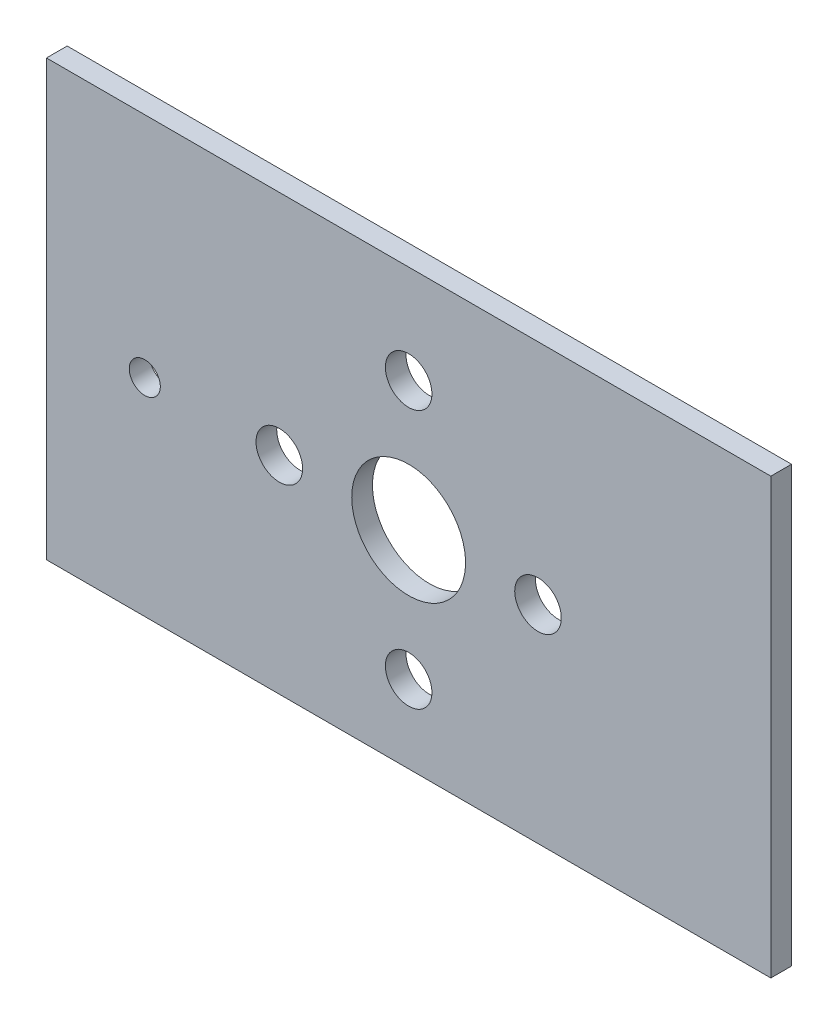
ISO-10303-21;
HEADER;
FILE_DESCRIPTION(('STEP AP214'),'2;1');
FILE_NAME('part.step','',(''),(''),'','','');
FILE_SCHEMA(('AUTOMOTIVE_DESIGN { 1 0 10303 214 1 1 1 1 }'));
ENDSEC;
DATA;
#1=APPLICATION_CONTEXT('core data for automotive mechanical design processes');
#2=APPLICATION_PROTOCOL_DEFINITION('international standard','automotive_design',2000,#1);
#3=PRODUCT_CONTEXT('',#1,'mechanical');
#4=PRODUCT('Part','Part','',(#3));
#5=PRODUCT_RELATED_PRODUCT_CATEGORY('part','',(#4));
#6=PRODUCT_DEFINITION_FORMATION('','',#4);
#7=PRODUCT_DEFINITION_CONTEXT('part definition',#1,'design');
#8=PRODUCT_DEFINITION('design','',#6,#7);
#9=PRODUCT_DEFINITION_SHAPE('','',#8);
#10=(LENGTH_UNIT() NAMED_UNIT(*) SI_UNIT(.MILLI.,.METRE.));
#11=(NAMED_UNIT(*) PLANE_ANGLE_UNIT() SI_UNIT($,.RADIAN.));
#12=(NAMED_UNIT(*) SI_UNIT($,.STERADIAN.) SOLID_ANGLE_UNIT());
#13=UNCERTAINTY_MEASURE_WITH_UNIT(LENGTH_MEASURE(1.E-05),#10,'distance_accuracy_value','');
#14=(GEOMETRIC_REPRESENTATION_CONTEXT(3) GLOBAL_UNCERTAINTY_ASSIGNED_CONTEXT((#13)) GLOBAL_UNIT_ASSIGNED_CONTEXT((#10,
#11,#12)) REPRESENTATION_CONTEXT('',''));
#15=CARTESIAN_POINT('',(0.,0.,0.));
#16=DIRECTION('',(0.,0.,1.));
#17=DIRECTION('',(1.,0.,0.));
#18=AXIS2_PLACEMENT_3D('',#15,#16,#17);
#19=CARTESIAN_POINT('',(0.,0.,2.));
#20=DIRECTION('',(1.,0.,0.));
#21=DIRECTION('',(0.,0.,-1.));
#22=AXIS2_PLACEMENT_3D('',#19,#20,#21);
#23=PLANE('',#22);
#24=DIRECTION('',(0.,-1.,0.));
#25=VECTOR('',#24,1.);
#26=CARTESIAN_POINT('',(0.,0.,0.));
#27=LINE('',#26,#25);
#28=CARTESIAN_POINT('',(0.,42.,0.));
#29=VERTEX_POINT('',#28);
#30=CARTESIAN_POINT('',(0.,0.,0.));
#31=VERTEX_POINT('',#30);
#32=EDGE_CURVE('E96',#29,#31,#27,.T.);
#33=ORIENTED_EDGE('',*,*,#32,.T.);
#34=DIRECTION('',(0.,0.,-1.));
#35=VECTOR('',#34,1.);
#36=CARTESIAN_POINT('',(0.,0.,2.));
#37=LINE('',#36,#35);
#38=CARTESIAN_POINT('',(0.,0.,2.));
#39=VERTEX_POINT('',#38);
#40=EDGE_CURVE('E11',#39,#31,#37,.T.);
#41=ORIENTED_EDGE('',*,*,#40,.F.);
#42=DIRECTION('',(0.,-1.,0.));
#43=VECTOR('',#42,1.);
#44=CARTESIAN_POINT('',(0.,0.,2.));
#45=LINE('',#44,#43);
#46=CARTESIAN_POINT('',(0.,42.,2.));
#47=VERTEX_POINT('',#46);
#48=EDGE_CURVE('E84',#47,#39,#45,.T.);
#49=ORIENTED_EDGE('',*,*,#48,.F.);
#50=DIRECTION('',(0.,0.,-1.));
#51=VECTOR('',#50,1.);
#52=CARTESIAN_POINT('',(0.,42.,2.));
#53=LINE('',#52,#51);
#54=EDGE_CURVE('E92',#47,#29,#53,.T.);
#55=ORIENTED_EDGE('',*,*,#54,.T.);
#56=EDGE_LOOP('',(#33,#41,#49,#55));
#57=FACE_BOUND('',#56,.T.);
#58=ADVANCED_FACE('F33',(#57),#23,.F.);
#59=CARTESIAN_POINT('',(0.,0.,2.));
#60=DIRECTION('',(0.,1.,0.));
#61=DIRECTION('',(0.,0.,1.));
#62=AXIS2_PLACEMENT_3D('',#59,#60,#61);
#63=PLANE('',#62);
#64=DIRECTION('',(1.,0.,0.));
#65=VECTOR('',#64,1.);
#66=CARTESIAN_POINT('',(0.,0.,0.));
#67=LINE('',#66,#65);
#68=CARTESIAN_POINT('',(70.,0.,0.));
#69=VERTEX_POINT('',#68);
#70=EDGE_CURVE('E88',#31,#69,#67,.T.);
#71=ORIENTED_EDGE('',*,*,#70,.T.);
#72=DIRECTION('',(0.,0.,-1.));
#73=VECTOR('',#72,1.);
#74=CARTESIAN_POINT('',(70.,0.,2.));
#75=LINE('',#74,#73);
#76=CARTESIAN_POINT('',(70.,0.,2.));
#77=VERTEX_POINT('',#76);
#78=EDGE_CURVE('E41',#77,#69,#75,.T.);
#79=ORIENTED_EDGE('',*,*,#78,.F.);
#80=DIRECTION('',(1.,0.,0.));
#81=VECTOR('',#80,1.);
#82=CARTESIAN_POINT('',(0.,0.,2.));
#83=LINE('',#82,#81);
#84=EDGE_CURVE('E79',#39,#77,#83,.T.);
#85=ORIENTED_EDGE('',*,*,#84,.F.);
#86=ORIENTED_EDGE('',*,*,#40,.T.);
#87=EDGE_LOOP('',(#71,#79,#85,#86));
#88=FACE_BOUND('',#87,.T.);
#89=ADVANCED_FACE('F87',(#88),#63,.F.);
#90=CARTESIAN_POINT('',(70.,0.,2.));
#91=DIRECTION('',(-1.,0.,0.));
#92=DIRECTION('',(0.,0.,1.));
#93=AXIS2_PLACEMENT_3D('',#90,#91,#92);
#94=PLANE('',#93);
#95=DIRECTION('',(0.,1.,0.));
#96=VECTOR('',#95,1.);
#97=CARTESIAN_POINT('',(70.,0.,0.));
#98=LINE('',#97,#96);
#99=CARTESIAN_POINT('',(70.,42.,0.));
#100=VERTEX_POINT('',#99);
#101=EDGE_CURVE('E66',#69,#100,#98,.T.);
#102=ORIENTED_EDGE('',*,*,#101,.T.);
#103=DIRECTION('',(0.,0.,-1.));
#104=VECTOR('',#103,1.);
#105=CARTESIAN_POINT('',(70.,42.,2.));
#106=LINE('',#105,#104);
#107=CARTESIAN_POINT('',(70.,42.,2.));
#108=VERTEX_POINT('',#107);
#109=EDGE_CURVE('E89',#108,#100,#106,.T.);
#110=ORIENTED_EDGE('',*,*,#109,.F.);
#111=DIRECTION('',(0.,1.,0.));
#112=VECTOR('',#111,1.);
#113=CARTESIAN_POINT('',(70.,0.,2.));
#114=LINE('',#113,#112);
#115=EDGE_CURVE('E82',#77,#108,#114,.T.);
#116=ORIENTED_EDGE('',*,*,#115,.F.);
#117=ORIENTED_EDGE('',*,*,#78,.T.);
#118=EDGE_LOOP('',(#102,#110,#116,#117));
#119=FACE_BOUND('',#118,.T.);
#120=ADVANCED_FACE('F90',(#119),#94,.F.);
#121=CARTESIAN_POINT('',(0.,42.,2.));
#122=DIRECTION('',(0.,-1.,0.));
#123=DIRECTION('',(0.,0.,-1.));
#124=AXIS2_PLACEMENT_3D('',#121,#122,#123);
#125=PLANE('',#124);
#126=DIRECTION('',(-1.,0.,0.));
#127=VECTOR('',#126,1.);
#128=CARTESIAN_POINT('',(0.,42.,0.));
#129=LINE('',#128,#127);
#130=EDGE_CURVE('E72',#100,#29,#129,.T.);
#131=ORIENTED_EDGE('',*,*,#130,.T.);
#132=ORIENTED_EDGE('',*,*,#54,.F.);
#133=DIRECTION('',(-1.,0.,0.));
#134=VECTOR('',#133,1.);
#135=CARTESIAN_POINT('',(0.,42.,2.));
#136=LINE('',#135,#134);
#137=EDGE_CURVE('E49',#108,#47,#136,.T.);
#138=ORIENTED_EDGE('',*,*,#137,.F.);
#139=ORIENTED_EDGE('',*,*,#109,.T.);
#140=EDGE_LOOP('',(#131,#132,#138,#139));
#141=FACE_BOUND('',#140,.T.);
#142=ADVANCED_FACE('F104',(#141),#125,.F.);
#143=CARTESIAN_POINT('',(0.,0.,2.));
#144=DIRECTION('',(0.,0.,-1.));
#145=DIRECTION('',(-1.,0.,0.));
#146=AXIS2_PLACEMENT_3D('',#143,#144,#145);
#147=PLANE('',#146);
#148=CARTESIAN_POINT('',(9.50000000000001,20.,2.));
#149=DIRECTION('',(0.,0.,-1.));
#150=DIRECTION('',(-1.,0.,0.));
#151=AXIS2_PLACEMENT_3D('',#148,#149,#150);
#152=CIRCLE('',#151,1.5);
#153=CARTESIAN_POINT('',(8.,20.,2.));
#154=VERTEX_POINT('',#153);
#155=EDGE_CURVE('E137',#154,#154,#152,.T.);
#156=ORIENTED_EDGE('',*,*,#155,.T.);
#157=EDGE_LOOP('',(#156));
#158=FACE_BOUND('',#157,.T.);
#159=CARTESIAN_POINT('',(35.,20.,2.));
#160=DIRECTION('',(0.,0.,-1.));
#161=DIRECTION('',(-1.,0.,0.));
#162=AXIS2_PLACEMENT_3D('',#159,#160,#161);
#163=CIRCLE('',#162,5.5);
#164=CARTESIAN_POINT('',(29.5,20.,2.));
#165=VERTEX_POINT('',#164);
#166=EDGE_CURVE('E133',#165,#165,#163,.T.);
#167=ORIENTED_EDGE('',*,*,#166,.T.);
#168=EDGE_LOOP('',(#167));
#169=FACE_BOUND('',#168,.T.);
#170=CARTESIAN_POINT('',(35.,32.5,2.));
#171=DIRECTION('',(0.,0.,-1.));
#172=DIRECTION('',(-1.,0.,0.));
#173=AXIS2_PLACEMENT_3D('',#170,#171,#172);
#174=CIRCLE('',#173,2.25);
#175=CARTESIAN_POINT('',(32.75,32.5,2.));
#176=VERTEX_POINT('',#175);
#177=EDGE_CURVE('E127',#176,#176,#174,.T.);
#178=ORIENTED_EDGE('',*,*,#177,.T.);
#179=EDGE_LOOP('',(#178));
#180=FACE_BOUND('',#179,.T.);
#181=CARTESIAN_POINT('',(47.5,20.,2.));
#182=DIRECTION('',(0.,0.,-1.));
#183=DIRECTION('',(-1.,0.,0.));
#184=AXIS2_PLACEMENT_3D('',#181,#182,#183);
#185=CIRCLE('',#184,2.25);
#186=CARTESIAN_POINT('',(45.25,20.,2.));
#187=VERTEX_POINT('',#186);
#188=EDGE_CURVE('E121',#187,#187,#185,.T.);
#189=ORIENTED_EDGE('',*,*,#188,.T.);
#190=EDGE_LOOP('',(#189));
#191=FACE_BOUND('',#190,.T.);
#192=CARTESIAN_POINT('',(35.,7.5,2.));
#193=DIRECTION('',(0.,0.,-1.));
#194=DIRECTION('',(-1.,0.,0.));
#195=AXIS2_PLACEMENT_3D('',#192,#193,#194);
#196=CIRCLE('',#195,2.25);
#197=CARTESIAN_POINT('',(32.75,7.5,2.));
#198=VERTEX_POINT('',#197);
#199=EDGE_CURVE('E115',#198,#198,#196,.T.);
#200=ORIENTED_EDGE('',*,*,#199,.T.);
#201=EDGE_LOOP('',(#200));
#202=FACE_BOUND('',#201,.T.);
#203=CARTESIAN_POINT('',(22.5,20.,2.));
#204=DIRECTION('',(0.,0.,-1.));
#205=DIRECTION('',(-1.,0.,0.));
#206=AXIS2_PLACEMENT_3D('',#203,#204,#205);
#207=CIRCLE('',#206,2.25);
#208=CARTESIAN_POINT('',(20.25,20.,2.));
#209=VERTEX_POINT('',#208);
#210=EDGE_CURVE('E99',#209,#209,#207,.T.);
#211=ORIENTED_EDGE('',*,*,#210,.T.);
#212=EDGE_LOOP('',(#211));
#213=FACE_BOUND('',#212,.T.);
#214=ORIENTED_EDGE('',*,*,#48,.T.);
#215=ORIENTED_EDGE('',*,*,#84,.T.);
#216=ORIENTED_EDGE('',*,*,#115,.T.);
#217=ORIENTED_EDGE('',*,*,#137,.T.);
#218=EDGE_LOOP('',(#214,#215,#216,#217));
#219=FACE_BOUND('',#218,.T.);
#220=ADVANCED_FACE('F80',(#158,#169,#180,#191,#202,#213,#219),#147,.F.);
#221=CARTESIAN_POINT('',(0.,0.,0.));
#222=DIRECTION('',(0.,0.,-1.));
#223=DIRECTION('',(-1.,0.,0.));
#224=AXIS2_PLACEMENT_3D('',#221,#222,#223);
#225=PLANE('',#224);
#226=CARTESIAN_POINT('',(9.50000000000001,20.,0.));
#227=DIRECTION('',(0.,0.,-1.));
#228=DIRECTION('',(-1.,0.,0.));
#229=AXIS2_PLACEMENT_3D('',#226,#227,#228);
#230=CIRCLE('',#229,1.5);
#231=CARTESIAN_POINT('',(8.,20.,0.));
#232=VERTEX_POINT('',#231);
#233=EDGE_CURVE('E140',#232,#232,#230,.T.);
#234=ORIENTED_EDGE('',*,*,#233,.F.);
#235=EDGE_LOOP('',(#234));
#236=FACE_BOUND('',#235,.T.);
#237=CARTESIAN_POINT('',(35.,20.,0.));
#238=DIRECTION('',(0.,0.,-1.));
#239=DIRECTION('',(-1.,0.,0.));
#240=AXIS2_PLACEMENT_3D('',#237,#238,#239);
#241=CIRCLE('',#240,5.5);
#242=CARTESIAN_POINT('',(29.5,20.,0.));
#243=VERTEX_POINT('',#242);
#244=EDGE_CURVE('E134',#243,#243,#241,.T.);
#245=ORIENTED_EDGE('',*,*,#244,.F.);
#246=EDGE_LOOP('',(#245));
#247=FACE_BOUND('',#246,.T.);
#248=CARTESIAN_POINT('',(35.,32.5,0.));
#249=DIRECTION('',(0.,0.,-1.));
#250=DIRECTION('',(-1.,0.,0.));
#251=AXIS2_PLACEMENT_3D('',#248,#249,#250);
#252=CIRCLE('',#251,2.25);
#253=CARTESIAN_POINT('',(32.75,32.5,0.));
#254=VERTEX_POINT('',#253);
#255=EDGE_CURVE('E130',#254,#254,#252,.T.);
#256=ORIENTED_EDGE('',*,*,#255,.F.);
#257=EDGE_LOOP('',(#256));
#258=FACE_BOUND('',#257,.T.);
#259=CARTESIAN_POINT('',(47.5,20.,0.));
#260=DIRECTION('',(0.,0.,-1.));
#261=DIRECTION('',(-1.,0.,0.));
#262=AXIS2_PLACEMENT_3D('',#259,#260,#261);
#263=CIRCLE('',#262,2.25);
#264=CARTESIAN_POINT('',(45.25,20.,0.));
#265=VERTEX_POINT('',#264);
#266=EDGE_CURVE('E124',#265,#265,#263,.T.);
#267=ORIENTED_EDGE('',*,*,#266,.F.);
#268=EDGE_LOOP('',(#267));
#269=FACE_BOUND('',#268,.T.);
#270=CARTESIAN_POINT('',(35.,7.5,0.));
#271=DIRECTION('',(0.,0.,-1.));
#272=DIRECTION('',(-1.,0.,0.));
#273=AXIS2_PLACEMENT_3D('',#270,#271,#272);
#274=CIRCLE('',#273,2.25);
#275=CARTESIAN_POINT('',(32.75,7.5,0.));
#276=VERTEX_POINT('',#275);
#277=EDGE_CURVE('E118',#276,#276,#274,.T.);
#278=ORIENTED_EDGE('',*,*,#277,.F.);
#279=EDGE_LOOP('',(#278));
#280=FACE_BOUND('',#279,.T.);
#281=CARTESIAN_POINT('',(22.5,20.,0.));
#282=DIRECTION('',(0.,0.,-1.));
#283=DIRECTION('',(-1.,0.,0.));
#284=AXIS2_PLACEMENT_3D('',#281,#282,#283);
#285=CIRCLE('',#284,2.25);
#286=CARTESIAN_POINT('',(20.25,20.,0.));
#287=VERTEX_POINT('',#286);
#288=EDGE_CURVE('E112',#287,#287,#285,.T.);
#289=ORIENTED_EDGE('',*,*,#288,.F.);
#290=EDGE_LOOP('',(#289));
#291=FACE_BOUND('',#290,.T.);
#292=ORIENTED_EDGE('',*,*,#32,.F.);
#293=ORIENTED_EDGE('',*,*,#130,.F.);
#294=ORIENTED_EDGE('',*,*,#101,.F.);
#295=ORIENTED_EDGE('',*,*,#70,.F.);
#296=EDGE_LOOP('',(#292,#293,#294,#295));
#297=FACE_BOUND('',#296,.T.);
#298=ADVANCED_FACE('F107',(#236,#247,#258,#269,#280,#291,#297),#225,.T.);
#299=CARTESIAN_POINT('',(22.5,20.,0.));
#300=DIRECTION('',(0.,0.,-1.));
#301=DIRECTION('',(-1.,0.,0.));
#302=AXIS2_PLACEMENT_3D('',#299,#300,#301);
#303=CYLINDRICAL_SURFACE('',#302,2.25);
#304=ORIENTED_EDGE('',*,*,#210,.F.);
#305=EDGE_LOOP('',(#304));
#306=FACE_BOUND('',#305,.T.);
#307=ORIENTED_EDGE('',*,*,#288,.T.);
#308=EDGE_LOOP('',(#307));
#309=FACE_BOUND('',#308,.T.);
#310=ADVANCED_FACE('F157',(#306,#309),#303,.F.);
#311=CARTESIAN_POINT('',(35.,7.5,0.));
#312=DIRECTION('',(0.,0.,-1.));
#313=DIRECTION('',(-1.,0.,0.));
#314=AXIS2_PLACEMENT_3D('',#311,#312,#313);
#315=CYLINDRICAL_SURFACE('',#314,2.25);
#316=ORIENTED_EDGE('',*,*,#199,.F.);
#317=EDGE_LOOP('',(#316));
#318=FACE_BOUND('',#317,.T.);
#319=ORIENTED_EDGE('',*,*,#277,.T.);
#320=EDGE_LOOP('',(#319));
#321=FACE_BOUND('',#320,.T.);
#322=ADVANCED_FACE('F170',(#318,#321),#315,.F.);
#323=CARTESIAN_POINT('',(47.5,20.,0.));
#324=DIRECTION('',(0.,0.,-1.));
#325=DIRECTION('',(-1.,0.,0.));
#326=AXIS2_PLACEMENT_3D('',#323,#324,#325);
#327=CYLINDRICAL_SURFACE('',#326,2.25);
#328=ORIENTED_EDGE('',*,*,#188,.F.);
#329=EDGE_LOOP('',(#328));
#330=FACE_BOUND('',#329,.T.);
#331=ORIENTED_EDGE('',*,*,#266,.T.);
#332=EDGE_LOOP('',(#331));
#333=FACE_BOUND('',#332,.T.);
#334=ADVANCED_FACE('F177',(#330,#333),#327,.F.);
#335=CARTESIAN_POINT('',(35.,32.5,0.));
#336=DIRECTION('',(0.,0.,-1.));
#337=DIRECTION('',(-1.,0.,0.));
#338=AXIS2_PLACEMENT_3D('',#335,#336,#337);
#339=CYLINDRICAL_SURFACE('',#338,2.25);
#340=ORIENTED_EDGE('',*,*,#177,.F.);
#341=EDGE_LOOP('',(#340));
#342=FACE_BOUND('',#341,.T.);
#343=ORIENTED_EDGE('',*,*,#255,.T.);
#344=EDGE_LOOP('',(#343));
#345=FACE_BOUND('',#344,.T.);
#346=ADVANCED_FACE('F213',(#342,#345),#339,.F.);
#347=CARTESIAN_POINT('',(35.,20.,2.));
#348=DIRECTION('',(0.,0.,-1.));
#349=DIRECTION('',(-1.,0.,0.));
#350=AXIS2_PLACEMENT_3D('',#347,#348,#349);
#351=CYLINDRICAL_SURFACE('',#350,5.5);
#352=ORIENTED_EDGE('',*,*,#166,.F.);
#353=EDGE_LOOP('',(#352));
#354=FACE_BOUND('',#353,.T.);
#355=ORIENTED_EDGE('',*,*,#244,.T.);
#356=EDGE_LOOP('',(#355));
#357=FACE_BOUND('',#356,.T.);
#358=ADVANCED_FACE('F151',(#354,#357),#351,.F.);
#359=CARTESIAN_POINT('',(9.50000000000001,20.,2.));
#360=DIRECTION('',(0.,0.,-1.));
#361=DIRECTION('',(-1.,0.,0.));
#362=AXIS2_PLACEMENT_3D('',#359,#360,#361);
#363=CYLINDRICAL_SURFACE('',#362,1.5);
#364=ORIENTED_EDGE('',*,*,#155,.F.);
#365=EDGE_LOOP('',(#364));
#366=FACE_BOUND('',#365,.T.);
#367=ORIENTED_EDGE('',*,*,#233,.T.);
#368=EDGE_LOOP('',(#367));
#369=FACE_BOUND('',#368,.T.);
#370=ADVANCED_FACE('F148',(#366,#369),#363,.F.);
#371=CLOSED_SHELL('',(#58,#89,#120,#142,#220,#298,#310,#322,#334,#346,#358,#370));
#372=MANIFOLD_SOLID_BREP('B2',#371);
#373=ADVANCED_BREP_SHAPE_REPRESENTATION('',(#18,#372),#14);
#374=SHAPE_DEFINITION_REPRESENTATION(#9,#373);
ENDSEC;
END-ISO-10303-21;
